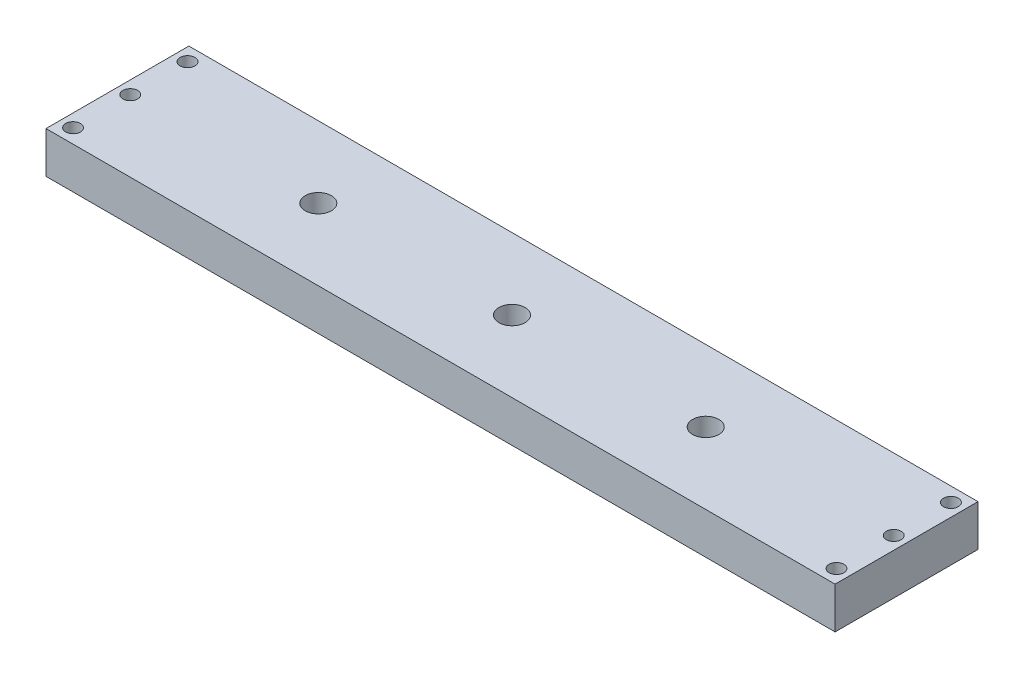
ISO-10303-21;
HEADER;
FILE_DESCRIPTION(('STEP AP214'),'2;1');
FILE_NAME('part.step','',(''),(''),'','','');
FILE_SCHEMA(('AUTOMOTIVE_DESIGN { 1 0 10303 214 1 1 1 1 }'));
ENDSEC;
DATA;
#1=APPLICATION_CONTEXT('core data for automotive mechanical design processes');
#2=APPLICATION_PROTOCOL_DEFINITION('international standard','automotive_design',2000,#1);
#3=PRODUCT_CONTEXT('',#1,'mechanical');
#4=PRODUCT('Part','Part','',(#3));
#5=PRODUCT_RELATED_PRODUCT_CATEGORY('part','',(#4));
#6=PRODUCT_DEFINITION_FORMATION('','',#4);
#7=PRODUCT_DEFINITION_CONTEXT('part definition',#1,'design');
#8=PRODUCT_DEFINITION('design','',#6,#7);
#9=PRODUCT_DEFINITION_SHAPE('','',#8);
#10=(LENGTH_UNIT() NAMED_UNIT(*) SI_UNIT(.MILLI.,.METRE.));
#11=(NAMED_UNIT(*) PLANE_ANGLE_UNIT() SI_UNIT($,.RADIAN.));
#12=(NAMED_UNIT(*) SI_UNIT($,.STERADIAN.) SOLID_ANGLE_UNIT());
#13=UNCERTAINTY_MEASURE_WITH_UNIT(LENGTH_MEASURE(1.E-05),#10,'distance_accuracy_value','');
#14=(GEOMETRIC_REPRESENTATION_CONTEXT(3) GLOBAL_UNCERTAINTY_ASSIGNED_CONTEXT((#13)) GLOBAL_UNIT_ASSIGNED_CONTEXT((#10,
#11,#12)) REPRESENTATION_CONTEXT('',''));
#15=CARTESIAN_POINT('',(0.,0.,0.));
#16=DIRECTION('',(0.,0.,1.));
#17=DIRECTION('',(1.,0.,0.));
#18=AXIS2_PLACEMENT_3D('',#15,#16,#17);
#19=CARTESIAN_POINT('',(101.6,10.668,18.39976));
#20=DIRECTION('',(-1.,0.,0.));
#21=DIRECTION('',(0.,0.,1.));
#22=AXIS2_PLACEMENT_3D('',#19,#20,#21);
#23=PLANE('',#22);
#24=DIRECTION('',(0.,0.,-1.));
#25=VECTOR('',#24,1.);
#26=CARTESIAN_POINT('',(101.6,0.,18.39976));
#27=LINE('',#26,#25);
#28=CARTESIAN_POINT('',(101.6,0.,18.39976));
#29=VERTEX_POINT('',#28);
#30=CARTESIAN_POINT('',(101.6,0.,-18.39976));
#31=VERTEX_POINT('',#30);
#32=EDGE_CURVE('E96',#29,#31,#27,.T.);
#33=ORIENTED_EDGE('',*,*,#32,.T.);
#34=DIRECTION('',(0.,-1.,0.));
#35=VECTOR('',#34,1.);
#36=CARTESIAN_POINT('',(101.6,10.668,-18.39976));
#37=LINE('',#36,#35);
#38=CARTESIAN_POINT('',(101.6,10.668,-18.39976));
#39=VERTEX_POINT('',#38);
#40=EDGE_CURVE('E11',#39,#31,#37,.T.);
#41=ORIENTED_EDGE('',*,*,#40,.F.);
#42=DIRECTION('',(0.,0.,-1.));
#43=VECTOR('',#42,1.);
#44=CARTESIAN_POINT('',(101.6,10.668,18.39976));
#45=LINE('',#44,#43);
#46=CARTESIAN_POINT('',(101.6,10.668,18.39976));
#47=VERTEX_POINT('',#46);
#48=EDGE_CURVE('E84',#47,#39,#45,.T.);
#49=ORIENTED_EDGE('',*,*,#48,.F.);
#50=DIRECTION('',(0.,-1.,0.));
#51=VECTOR('',#50,1.);
#52=CARTESIAN_POINT('',(101.6,10.668,18.39976));
#53=LINE('',#52,#51);
#54=EDGE_CURVE('E92',#47,#29,#53,.T.);
#55=ORIENTED_EDGE('',*,*,#54,.T.);
#56=EDGE_LOOP('',(#33,#41,#49,#55));
#57=FACE_BOUND('',#56,.T.);
#58=ADVANCED_FACE('F33',(#57),#23,.F.);
#59=CARTESIAN_POINT('',(-101.6,10.668,-18.39976));
#60=DIRECTION('',(0.,0.,1.));
#61=DIRECTION('',(1.,0.,0.));
#62=AXIS2_PLACEMENT_3D('',#59,#60,#61);
#63=PLANE('',#62);
#64=DIRECTION('',(-1.,0.,0.));
#65=VECTOR('',#64,1.);
#66=CARTESIAN_POINT('',(-101.6,0.,-18.39976));
#67=LINE('',#66,#65);
#68=CARTESIAN_POINT('',(-101.6,0.,-18.39976));
#69=VERTEX_POINT('',#68);
#70=EDGE_CURVE('E88',#31,#69,#67,.T.);
#71=ORIENTED_EDGE('',*,*,#70,.T.);
#72=DIRECTION('',(0.,-1.,0.));
#73=VECTOR('',#72,1.);
#74=CARTESIAN_POINT('',(-101.6,10.668,-18.39976));
#75=LINE('',#74,#73);
#76=CARTESIAN_POINT('',(-101.6,10.668,-18.39976));
#77=VERTEX_POINT('',#76);
#78=EDGE_CURVE('E41',#77,#69,#75,.T.);
#79=ORIENTED_EDGE('',*,*,#78,.F.);
#80=DIRECTION('',(-1.,0.,0.));
#81=VECTOR('',#80,1.);
#82=CARTESIAN_POINT('',(-101.6,10.668,-18.39976));
#83=LINE('',#82,#81);
#84=EDGE_CURVE('E79',#39,#77,#83,.T.);
#85=ORIENTED_EDGE('',*,*,#84,.F.);
#86=ORIENTED_EDGE('',*,*,#40,.T.);
#87=EDGE_LOOP('',(#71,#79,#85,#86));
#88=FACE_BOUND('',#87,.T.);
#89=ADVANCED_FACE('F87',(#88),#63,.F.);
#90=CARTESIAN_POINT('',(-101.6,10.668,18.39976));
#91=DIRECTION('',(1.,0.,0.));
#92=DIRECTION('',(0.,0.,-1.));
#93=AXIS2_PLACEMENT_3D('',#90,#91,#92);
#94=PLANE('',#93);
#95=DIRECTION('',(0.,0.,1.));
#96=VECTOR('',#95,1.);
#97=CARTESIAN_POINT('',(-101.6,0.,18.39976));
#98=LINE('',#97,#96);
#99=CARTESIAN_POINT('',(-101.6,0.,18.39976));
#100=VERTEX_POINT('',#99);
#101=EDGE_CURVE('E66',#69,#100,#98,.T.);
#102=ORIENTED_EDGE('',*,*,#101,.T.);
#103=DIRECTION('',(0.,-1.,0.));
#104=VECTOR('',#103,1.);
#105=CARTESIAN_POINT('',(-101.6,10.668,18.39976));
#106=LINE('',#105,#104);
#107=CARTESIAN_POINT('',(-101.6,10.668,18.39976));
#108=VERTEX_POINT('',#107);
#109=EDGE_CURVE('E89',#108,#100,#106,.T.);
#110=ORIENTED_EDGE('',*,*,#109,.F.);
#111=DIRECTION('',(0.,0.,1.));
#112=VECTOR('',#111,1.);
#113=CARTESIAN_POINT('',(-101.6,10.668,18.39976));
#114=LINE('',#113,#112);
#115=EDGE_CURVE('E82',#77,#108,#114,.T.);
#116=ORIENTED_EDGE('',*,*,#115,.F.);
#117=ORIENTED_EDGE('',*,*,#78,.T.);
#118=EDGE_LOOP('',(#102,#110,#116,#117));
#119=FACE_BOUND('',#118,.T.);
#120=ADVANCED_FACE('F90',(#119),#94,.F.);
#121=CARTESIAN_POINT('',(-101.6,10.668,18.39976));
#122=DIRECTION('',(0.,0.,-1.));
#123=DIRECTION('',(-1.,0.,0.));
#124=AXIS2_PLACEMENT_3D('',#121,#122,#123);
#125=PLANE('',#124);
#126=DIRECTION('',(1.,0.,0.));
#127=VECTOR('',#126,1.);
#128=CARTESIAN_POINT('',(-101.6,0.,18.39976));
#129=LINE('',#128,#127);
#130=EDGE_CURVE('E72',#100,#29,#129,.T.);
#131=ORIENTED_EDGE('',*,*,#130,.T.);
#132=ORIENTED_EDGE('',*,*,#54,.F.);
#133=DIRECTION('',(1.,0.,0.));
#134=VECTOR('',#133,1.);
#135=CARTESIAN_POINT('',(-101.6,10.668,18.39976));
#136=LINE('',#135,#134);
#137=EDGE_CURVE('E49',#108,#47,#136,.T.);
#138=ORIENTED_EDGE('',*,*,#137,.F.);
#139=ORIENTED_EDGE('',*,*,#109,.T.);
#140=EDGE_LOOP('',(#131,#132,#138,#139));
#141=FACE_BOUND('',#140,.T.);
#142=ADVANCED_FACE('F104',(#141),#125,.F.);
#143=CARTESIAN_POINT('',(0.,10.668,0.));
#144=DIRECTION('',(0.,-1.,0.));
#145=DIRECTION('',(0.,0.,-1.));
#146=AXIS2_PLACEMENT_3D('',#143,#144,#145);
#147=PLANE('',#146);
#148=CARTESIAN_POINT('',(-49.8855999999999,10.668,0.));
#149=DIRECTION('',(0.,1.,0.));
#150=DIRECTION('',(0.,0.,-1.));
#151=AXIS2_PLACEMENT_3D('',#148,#149,#150);
#152=CIRCLE('',#151,3.3782);
#153=CARTESIAN_POINT('',(-49.8855999999999,10.668,-3.3782));
#154=VERTEX_POINT('',#153);
#155=EDGE_CURVE('E152',#154,#154,#152,.T.);
#156=ORIENTED_EDGE('',*,*,#155,.F.);
#157=EDGE_LOOP('',(#156));
#158=FACE_BOUND('',#157,.T.);
#159=CARTESIAN_POINT('',(49.8856,10.668,0.));
#160=DIRECTION('',(0.,1.,0.));
#161=DIRECTION('',(0.,0.,1.));
#162=AXIS2_PLACEMENT_3D('',#159,#160,#161);
#163=CIRCLE('',#162,3.3782);
#164=CARTESIAN_POINT('',(49.8856,10.668,3.3782));
#165=VERTEX_POINT('',#164);
#166=EDGE_CURVE('E158',#165,#165,#163,.T.);
#167=ORIENTED_EDGE('',*,*,#166,.F.);
#168=EDGE_LOOP('',(#167));
#169=FACE_BOUND('',#168,.T.);
#170=CARTESIAN_POINT('',(0.,10.668,0.));
#171=DIRECTION('',(0.,1.,0.));
#172=DIRECTION('',(0.,0.,1.));
#173=AXIS2_PLACEMENT_3D('',#170,#171,#172);
#174=CIRCLE('',#173,3.3782);
#175=CARTESIAN_POINT('',(0.,10.668,3.3782));
#176=VERTEX_POINT('',#175);
#177=EDGE_CURVE('E146',#176,#176,#174,.T.);
#178=ORIENTED_EDGE('',*,*,#177,.F.);
#179=EDGE_LOOP('',(#178));
#180=FACE_BOUND('',#179,.T.);
#181=CARTESIAN_POINT('',(98.298,10.668,14.732));
#182=DIRECTION('',(0.,1.,0.));
#183=DIRECTION('',(0.,0.,-1.));
#184=AXIS2_PLACEMENT_3D('',#181,#182,#183);
#185=CIRCLE('',#184,1.90500000000001);
#186=CARTESIAN_POINT('',(98.298,10.668,12.827));
#187=VERTEX_POINT('',#186);
#188=EDGE_CURVE('E114',#187,#187,#185,.T.);
#189=ORIENTED_EDGE('',*,*,#188,.F.);
#190=EDGE_LOOP('',(#189));
#191=FACE_BOUND('',#190,.T.);
#192=CARTESIAN_POINT('',(98.298,10.668,0.));
#193=DIRECTION('',(0.,1.,0.));
#194=DIRECTION('',(0.,0.,-1.));
#195=AXIS2_PLACEMENT_3D('',#192,#193,#194);
#196=CIRCLE('',#195,1.90500000000001);
#197=CARTESIAN_POINT('',(98.298,10.668,-1.90500000000001));
#198=VERTEX_POINT('',#197);
#199=EDGE_CURVE('E138',#198,#198,#196,.T.);
#200=ORIENTED_EDGE('',*,*,#199,.F.);
#201=EDGE_LOOP('',(#200));
#202=FACE_BOUND('',#201,.T.);
#203=CARTESIAN_POINT('',(98.298,10.668,-14.732));
#204=DIRECTION('',(0.,1.,0.));
#205=DIRECTION('',(0.,0.,-1.));
#206=AXIS2_PLACEMENT_3D('',#203,#204,#205);
#207=CIRCLE('',#206,1.90500000000001);
#208=CARTESIAN_POINT('',(98.298,10.668,-16.637));
#209=VERTEX_POINT('',#208);
#210=EDGE_CURVE('E131',#209,#209,#207,.T.);
#211=ORIENTED_EDGE('',*,*,#210,.F.);
#212=EDGE_LOOP('',(#211));
#213=FACE_BOUND('',#212,.T.);
#214=CARTESIAN_POINT('',(-98.298,10.668,14.732));
#215=DIRECTION('',(0.,-1.,0.));
#216=DIRECTION('',(0.,0.,-1.));
#217=AXIS2_PLACEMENT_3D('',#214,#215,#216);
#218=CIRCLE('',#217,1.90500000000001);
#219=CARTESIAN_POINT('',(-98.298,10.668,12.827));
#220=VERTEX_POINT('',#219);
#221=EDGE_CURVE('E99',#220,#220,#218,.T.);
#222=ORIENTED_EDGE('',*,*,#221,.T.);
#223=EDGE_LOOP('',(#222));
#224=FACE_BOUND('',#223,.T.);
#225=CARTESIAN_POINT('',(-98.298,10.668,0.));
#226=DIRECTION('',(0.,-1.,0.));
#227=DIRECTION('',(0.,0.,-1.));
#228=AXIS2_PLACEMENT_3D('',#225,#226,#227);
#229=CIRCLE('',#228,1.90500000000001);
#230=CARTESIAN_POINT('',(-98.298,10.668,-1.90500000000001));
#231=VERTEX_POINT('',#230);
#232=EDGE_CURVE('E120',#231,#231,#229,.T.);
#233=ORIENTED_EDGE('',*,*,#232,.T.);
#234=EDGE_LOOP('',(#233));
#235=FACE_BOUND('',#234,.T.);
#236=CARTESIAN_POINT('',(-98.298,10.668,-14.732));
#237=DIRECTION('',(0.,-1.,0.));
#238=DIRECTION('',(0.,0.,-1.));
#239=AXIS2_PLACEMENT_3D('',#236,#237,#238);
#240=CIRCLE('',#239,1.90500000000001);
#241=CARTESIAN_POINT('',(-98.298,10.668,-16.637));
#242=VERTEX_POINT('',#241);
#243=EDGE_CURVE('E113',#242,#242,#240,.T.);
#244=ORIENTED_EDGE('',*,*,#243,.T.);
#245=EDGE_LOOP('',(#244));
#246=FACE_BOUND('',#245,.T.);
#247=ORIENTED_EDGE('',*,*,#48,.T.);
#248=ORIENTED_EDGE('',*,*,#84,.T.);
#249=ORIENTED_EDGE('',*,*,#115,.T.);
#250=ORIENTED_EDGE('',*,*,#137,.T.);
#251=EDGE_LOOP('',(#247,#248,#249,#250));
#252=FACE_BOUND('',#251,.T.);
#253=ADVANCED_FACE('F80',(#158,#169,#180,#191,#202,#213,#224,#235,#246,#252),#147,.F.);
#254=CARTESIAN_POINT('',(0.,0.,0.));
#255=DIRECTION('',(0.,-1.,0.));
#256=DIRECTION('',(0.,0.,-1.));
#257=AXIS2_PLACEMENT_3D('',#254,#255,#256);
#258=PLANE('',#257);
#259=CARTESIAN_POINT('',(-49.8855999999999,0.,0.));
#260=DIRECTION('',(0.,1.,0.));
#261=DIRECTION('',(0.,0.,-1.));
#262=AXIS2_PLACEMENT_3D('',#259,#260,#261);
#263=CIRCLE('',#262,3.3782);
#264=CARTESIAN_POINT('',(-49.8855999999999,0.,-3.3782));
#265=VERTEX_POINT('',#264);
#266=EDGE_CURVE('E155',#265,#265,#263,.T.);
#267=ORIENTED_EDGE('',*,*,#266,.T.);
#268=EDGE_LOOP('',(#267));
#269=FACE_BOUND('',#268,.T.);
#270=CARTESIAN_POINT('',(49.8856,0.,0.));
#271=DIRECTION('',(0.,1.,0.));
#272=DIRECTION('',(0.,0.,1.));
#273=AXIS2_PLACEMENT_3D('',#270,#271,#272);
#274=CIRCLE('',#273,3.3782);
#275=CARTESIAN_POINT('',(49.8856,0.,3.3782));
#276=VERTEX_POINT('',#275);
#277=EDGE_CURVE('E149',#276,#276,#274,.T.);
#278=ORIENTED_EDGE('',*,*,#277,.T.);
#279=EDGE_LOOP('',(#278));
#280=FACE_BOUND('',#279,.T.);
#281=CARTESIAN_POINT('',(0.,0.,0.));
#282=DIRECTION('',(0.,1.,0.));
#283=DIRECTION('',(0.,0.,1.));
#284=AXIS2_PLACEMENT_3D('',#281,#282,#283);
#285=CIRCLE('',#284,3.3782);
#286=CARTESIAN_POINT('',(0.,0.,3.3782));
#287=VERTEX_POINT('',#286);
#288=EDGE_CURVE('E132',#287,#287,#285,.T.);
#289=ORIENTED_EDGE('',*,*,#288,.T.);
#290=EDGE_LOOP('',(#289));
#291=FACE_BOUND('',#290,.T.);
#292=CARTESIAN_POINT('',(98.298,0.,14.732));
#293=DIRECTION('',(0.,1.,0.));
#294=DIRECTION('',(0.,0.,-1.));
#295=AXIS2_PLACEMENT_3D('',#292,#293,#294);
#296=CIRCLE('',#295,1.90500000000001);
#297=CARTESIAN_POINT('',(98.298,0.,12.827));
#298=VERTEX_POINT('',#297);
#299=EDGE_CURVE('E141',#298,#298,#296,.T.);
#300=ORIENTED_EDGE('',*,*,#299,.T.);
#301=EDGE_LOOP('',(#300));
#302=FACE_BOUND('',#301,.T.);
#303=CARTESIAN_POINT('',(98.298,0.,0.));
#304=DIRECTION('',(0.,1.,0.));
#305=DIRECTION('',(0.,0.,-1.));
#306=AXIS2_PLACEMENT_3D('',#303,#304,#305);
#307=CIRCLE('',#306,1.90500000000001);
#308=CARTESIAN_POINT('',(98.298,0.,-1.90500000000001));
#309=VERTEX_POINT('',#308);
#310=EDGE_CURVE('E135',#309,#309,#307,.T.);
#311=ORIENTED_EDGE('',*,*,#310,.T.);
#312=EDGE_LOOP('',(#311));
#313=FACE_BOUND('',#312,.T.);
#314=CARTESIAN_POINT('',(98.298,0.,-14.732));
#315=DIRECTION('',(0.,1.,0.));
#316=DIRECTION('',(0.,0.,-1.));
#317=AXIS2_PLACEMENT_3D('',#314,#315,#316);
#318=CIRCLE('',#317,1.90500000000001);
#319=CARTESIAN_POINT('',(98.298,0.,-16.637));
#320=VERTEX_POINT('',#319);
#321=EDGE_CURVE('E128',#320,#320,#318,.T.);
#322=ORIENTED_EDGE('',*,*,#321,.T.);
#323=EDGE_LOOP('',(#322));
#324=FACE_BOUND('',#323,.T.);
#325=CARTESIAN_POINT('',(-98.298,0.,14.732));
#326=DIRECTION('',(0.,-1.,0.));
#327=DIRECTION('',(0.,0.,-1.));
#328=AXIS2_PLACEMENT_3D('',#325,#326,#327);
#329=CIRCLE('',#328,1.90500000000001);
#330=CARTESIAN_POINT('',(-98.298,0.,12.827));
#331=VERTEX_POINT('',#330);
#332=EDGE_CURVE('E123',#331,#331,#329,.T.);
#333=ORIENTED_EDGE('',*,*,#332,.F.);
#334=EDGE_LOOP('',(#333));
#335=FACE_BOUND('',#334,.T.);
#336=CARTESIAN_POINT('',(-98.298,0.,0.));
#337=DIRECTION('',(0.,-1.,0.));
#338=DIRECTION('',(0.,0.,-1.));
#339=AXIS2_PLACEMENT_3D('',#336,#337,#338);
#340=CIRCLE('',#339,1.90500000000001);
#341=CARTESIAN_POINT('',(-98.298,0.,-1.90500000000001));
#342=VERTEX_POINT('',#341);
#343=EDGE_CURVE('E117',#342,#342,#340,.T.);
#344=ORIENTED_EDGE('',*,*,#343,.F.);
#345=EDGE_LOOP('',(#344));
#346=FACE_BOUND('',#345,.T.);
#347=CARTESIAN_POINT('',(-98.298,0.,-14.732));
#348=DIRECTION('',(0.,-1.,0.));
#349=DIRECTION('',(0.,0.,-1.));
#350=AXIS2_PLACEMENT_3D('',#347,#348,#349);
#351=CIRCLE('',#350,1.90500000000001);
#352=CARTESIAN_POINT('',(-98.298,0.,-16.637));
#353=VERTEX_POINT('',#352);
#354=EDGE_CURVE('E110',#353,#353,#351,.T.);
#355=ORIENTED_EDGE('',*,*,#354,.F.);
#356=EDGE_LOOP('',(#355));
#357=FACE_BOUND('',#356,.T.);
#358=ORIENTED_EDGE('',*,*,#32,.F.);
#359=ORIENTED_EDGE('',*,*,#130,.F.);
#360=ORIENTED_EDGE('',*,*,#101,.F.);
#361=ORIENTED_EDGE('',*,*,#70,.F.);
#362=EDGE_LOOP('',(#358,#359,#360,#361));
#363=FACE_BOUND('',#362,.T.);
#364=ADVANCED_FACE('F107',(#269,#280,#291,#302,#313,#324,#335,#346,#357,#363),#258,.T.);
#365=CARTESIAN_POINT('',(-98.298,10.668,-14.732));
#366=DIRECTION('',(0.,-1.,0.));
#367=DIRECTION('',(0.,0.,-1.));
#368=AXIS2_PLACEMENT_3D('',#365,#366,#367);
#369=CYLINDRICAL_SURFACE('',#368,1.90500000000001);
#370=ORIENTED_EDGE('',*,*,#243,.F.);
#371=EDGE_LOOP('',(#370));
#372=FACE_BOUND('',#371,.T.);
#373=ORIENTED_EDGE('',*,*,#354,.T.);
#374=EDGE_LOOP('',(#373));
#375=FACE_BOUND('',#374,.T.);
#376=ADVANCED_FACE('F192',(#372,#375),#369,.F.);
#377=CARTESIAN_POINT('',(-98.298,10.668,0.));
#378=DIRECTION('',(0.,-1.,0.));
#379=DIRECTION('',(0.,0.,-1.));
#380=AXIS2_PLACEMENT_3D('',#377,#378,#379);
#381=CYLINDRICAL_SURFACE('',#380,1.90500000000001);
#382=ORIENTED_EDGE('',*,*,#232,.F.);
#383=EDGE_LOOP('',(#382));
#384=FACE_BOUND('',#383,.T.);
#385=ORIENTED_EDGE('',*,*,#343,.T.);
#386=EDGE_LOOP('',(#385));
#387=FACE_BOUND('',#386,.T.);
#388=ADVANCED_FACE('F195',(#384,#387),#381,.F.);
#389=CARTESIAN_POINT('',(-98.298,10.668,14.732));
#390=DIRECTION('',(0.,-1.,0.));
#391=DIRECTION('',(0.,0.,-1.));
#392=AXIS2_PLACEMENT_3D('',#389,#390,#391);
#393=CYLINDRICAL_SURFACE('',#392,1.90500000000001);
#394=ORIENTED_EDGE('',*,*,#221,.F.);
#395=EDGE_LOOP('',(#394));
#396=FACE_BOUND('',#395,.T.);
#397=ORIENTED_EDGE('',*,*,#332,.T.);
#398=EDGE_LOOP('',(#397));
#399=FACE_BOUND('',#398,.T.);
#400=ADVANCED_FACE('F274',(#396,#399),#393,.F.);
#401=CARTESIAN_POINT('',(98.298,10.668,-14.732));
#402=DIRECTION('',(0.,-1.,0.));
#403=DIRECTION('',(0.,0.,-1.));
#404=AXIS2_PLACEMENT_3D('',#401,#402,#403);
#405=CYLINDRICAL_SURFACE('',#404,1.90500000000001);
#406=ORIENTED_EDGE('',*,*,#210,.T.);
#407=EDGE_LOOP('',(#406));
#408=FACE_BOUND('',#407,.T.);
#409=ORIENTED_EDGE('',*,*,#321,.F.);
#410=EDGE_LOOP('',(#409));
#411=FACE_BOUND('',#410,.T.);
#412=ADVANCED_FACE('F270',(#408,#411),#405,.F.);
#413=CARTESIAN_POINT('',(98.298,10.668,0.));
#414=DIRECTION('',(0.,-1.,0.));
#415=DIRECTION('',(0.,0.,-1.));
#416=AXIS2_PLACEMENT_3D('',#413,#414,#415);
#417=CYLINDRICAL_SURFACE('',#416,1.90500000000001);
#418=ORIENTED_EDGE('',*,*,#199,.T.);
#419=EDGE_LOOP('',(#418));
#420=FACE_BOUND('',#419,.T.);
#421=ORIENTED_EDGE('',*,*,#310,.F.);
#422=EDGE_LOOP('',(#421));
#423=FACE_BOUND('',#422,.T.);
#424=ADVANCED_FACE('F266',(#420,#423),#417,.F.);
#425=CARTESIAN_POINT('',(98.298,10.668,14.732));
#426=DIRECTION('',(0.,-1.,0.));
#427=DIRECTION('',(0.,0.,-1.));
#428=AXIS2_PLACEMENT_3D('',#425,#426,#427);
#429=CYLINDRICAL_SURFACE('',#428,1.90500000000001);
#430=ORIENTED_EDGE('',*,*,#188,.T.);
#431=EDGE_LOOP('',(#430));
#432=FACE_BOUND('',#431,.T.);
#433=ORIENTED_EDGE('',*,*,#299,.F.);
#434=EDGE_LOOP('',(#433));
#435=FACE_BOUND('',#434,.T.);
#436=ADVANCED_FACE('F229',(#432,#435),#429,.F.);
#437=CARTESIAN_POINT('',(0.,0.,0.));
#438=DIRECTION('',(0.,1.,0.));
#439=DIRECTION('',(0.,0.,1.));
#440=AXIS2_PLACEMENT_3D('',#437,#438,#439);
#441=CYLINDRICAL_SURFACE('',#440,3.3782);
#442=ORIENTED_EDGE('',*,*,#288,.F.);
#443=EDGE_LOOP('',(#442));
#444=FACE_BOUND('',#443,.T.);
#445=ORIENTED_EDGE('',*,*,#177,.T.);
#446=EDGE_LOOP('',(#445));
#447=FACE_BOUND('',#446,.T.);
#448=ADVANCED_FACE('F170',(#444,#447),#441,.F.);
#449=CARTESIAN_POINT('',(49.8856,0.,0.));
#450=DIRECTION('',(0.,1.,0.));
#451=DIRECTION('',(0.,0.,1.));
#452=AXIS2_PLACEMENT_3D('',#449,#450,#451);
#453=CYLINDRICAL_SURFACE('',#452,3.3782);
#454=ORIENTED_EDGE('',*,*,#277,.F.);
#455=EDGE_LOOP('',(#454));
#456=FACE_BOUND('',#455,.T.);
#457=ORIENTED_EDGE('',*,*,#166,.T.);
#458=EDGE_LOOP('',(#457));
#459=FACE_BOUND('',#458,.T.);
#460=ADVANCED_FACE('F166',(#456,#459),#453,.F.);
#461=CARTESIAN_POINT('',(-49.8855999999999,0.,0.));
#462=DIRECTION('',(0.,1.,0.));
#463=DIRECTION('',(0.,0.,1.));
#464=AXIS2_PLACEMENT_3D('',#461,#462,#463);
#465=CYLINDRICAL_SURFACE('',#464,3.3782);
#466=ORIENTED_EDGE('',*,*,#266,.F.);
#467=EDGE_LOOP('',(#466));
#468=FACE_BOUND('',#467,.T.);
#469=ORIENTED_EDGE('',*,*,#155,.T.);
#470=EDGE_LOOP('',(#469));
#471=FACE_BOUND('',#470,.T.);
#472=ADVANCED_FACE('F169',(#468,#471),#465,.F.);
#473=CLOSED_SHELL('',(#58,#89,#120,#142,#253,#364,#376,#388,#400,#412,#424,#436,#448,#460,#472));
#474=MANIFOLD_SOLID_BREP('B2',#473);
#475=ADVANCED_BREP_SHAPE_REPRESENTATION('',(#18,#474),#14);
#476=SHAPE_DEFINITION_REPRESENTATION(#9,#475);
ENDSEC;
END-ISO-10303-21;
